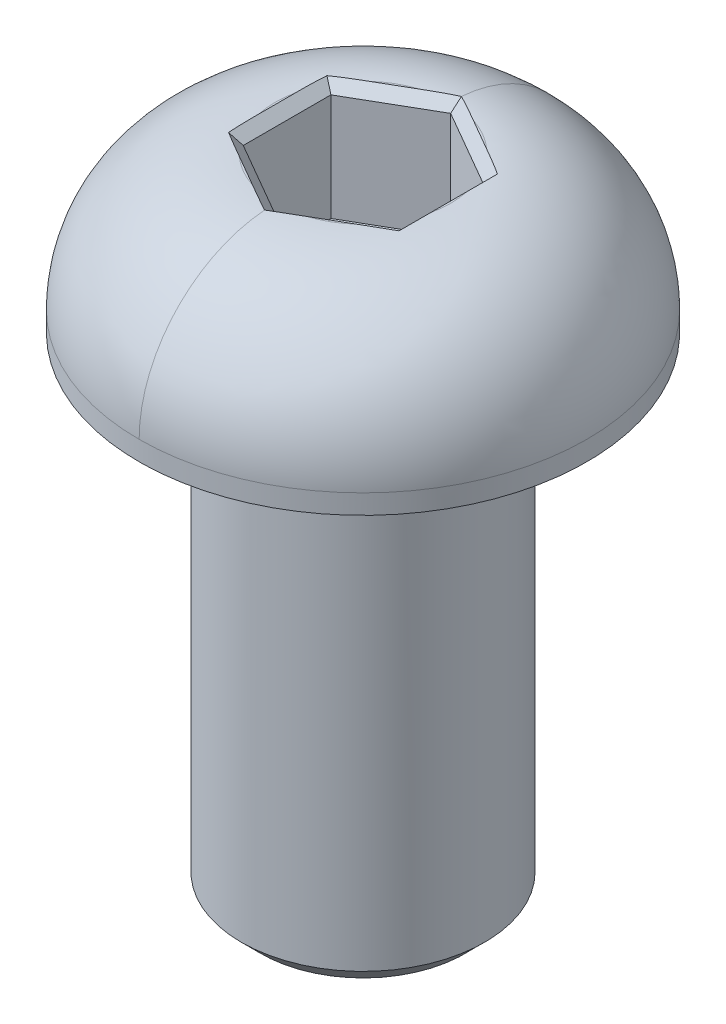
ISO-10303-21;
HEADER;
FILE_DESCRIPTION(('STEP AP214'),'2;1');
FILE_NAME('part.step','',(''),(''),'','','');
FILE_SCHEMA(('AUTOMOTIVE_DESIGN { 1 0 10303 214 1 1 1 1 }'));
ENDSEC;
DATA;
#1=APPLICATION_CONTEXT('core data for automotive mechanical design processes');
#2=APPLICATION_PROTOCOL_DEFINITION('international standard','automotive_design',2000,#1);
#3=PRODUCT_CONTEXT('',#1,'mechanical');
#4=PRODUCT('Part','Part','',(#3));
#5=PRODUCT_RELATED_PRODUCT_CATEGORY('part','',(#4));
#6=PRODUCT_DEFINITION_FORMATION('','',#4);
#7=PRODUCT_DEFINITION_CONTEXT('part definition',#1,'design');
#8=PRODUCT_DEFINITION('design','',#6,#7);
#9=PRODUCT_DEFINITION_SHAPE('','',#8);
#10=(LENGTH_UNIT() NAMED_UNIT(*) SI_UNIT(.MILLI.,.METRE.));
#11=(NAMED_UNIT(*) PLANE_ANGLE_UNIT() SI_UNIT($,.RADIAN.));
#12=(NAMED_UNIT(*) SI_UNIT($,.STERADIAN.) SOLID_ANGLE_UNIT());
#13=UNCERTAINTY_MEASURE_WITH_UNIT(LENGTH_MEASURE(1.E-05),#10,'distance_accuracy_value','');
#14=(GEOMETRIC_REPRESENTATION_CONTEXT(3) GLOBAL_UNCERTAINTY_ASSIGNED_CONTEXT((#13)) GLOBAL_UNIT_ASSIGNED_CONTEXT((#10,
#11,#12)) REPRESENTATION_CONTEXT('',''));
#15=CARTESIAN_POINT('',(0.,0.,0.));
#16=DIRECTION('',(0.,0.,1.));
#17=DIRECTION('',(1.,0.,0.));
#18=AXIS2_PLACEMENT_3D('',#15,#16,#17);
#19=CARTESIAN_POINT('',(0.55880000008816,-1.11759999977487,-0.967869991113236));
#20=DIRECTION('',(0.353553390699095,-0.70710678114419,-0.612372435683609));
#21=DIRECTION('',(0.,0.654653670722942,-0.755928946005494));
#22=AXIS2_PLACEMENT_3D('',#19,#20,#21);
#23=PLANE('',#22);
#24=CARTESIAN_POINT('',(1.53263941940356,0.,-1.69611686142561));
#25=CARTESIAN_POINT('',(1.57137439019135,-1.17832860178164E-06,-1.67375185499042));
#26=CARTESIAN_POINT('',(1.61009239010488,-3.70120175402417E-05,-1.65135663013081));
#27=CARTESIAN_POINT('',(1.68745429070755,-0.000245765725721834,-1.60645066795937));
#28=CARTESIAN_POINT('',(1.72609820022004,-0.000418668254930061,-1.58393994574912));
#29=CARTESIAN_POINT('',(1.80327785747174,-0.000969273808575009,-1.53874446531545));
#30=CARTESIAN_POINT('',(1.84181361550393,-0.00134695663002751,-1.5160597244778));
#31=CARTESIAN_POINT('',(1.91874334713456,-0.00237927994698004,-1.47045229890817));
#32=CARTESIAN_POINT('',(1.95713731322205,-0.00303393490776775,-1.44752960180958));
#33=CARTESIAN_POINT('',(2.03374194432457,-0.00469197365840326,-1.40138735916931));
#34=CARTESIAN_POINT('',(2.07195260074831,-0.00569537363430886,-1.37816779989777));
#35=CARTESIAN_POINT('',(2.14815301626423,-0.00811933718559276,-1.33137451745568));
#36=CARTESIAN_POINT('',(2.18614273140987,-0.00953998104167264,-1.30780072695751));
#37=CARTESIAN_POINT('',(2.22399670603845,-0.0112032937955187,-1.28402509637655));
#38=B_SPLINE_CURVE_WITH_KNOTS('',3,(#24,#25,#26,#27,#28,#29,#30,#31,#32,#33,#34,#35,#36,#37),
.UNSPECIFIED.,.F.,.F.,(4,2,2,2,2,2,4),(0.,0.134184534211138,0.268351949181293,0.402506130021046,
0.536667318130277,0.670834733800316,0.805027981169587),.UNSPECIFIED.);
#39=CARTESIAN_POINT('',(1.53263941949174,1.36519593373075E-11,-1.69611686157834));
#40=VERTEX_POINT('',#39);
#41=CARTESIAN_POINT('',(2.22399670602297,-0.0112032938027732,-1.28402509658571));
#42=VERTEX_POINT('',#41);
#43=EDGE_CURVE('E132',#40,#42,#38,.T.);
#44=ORIENTED_EDGE('',*,*,#43,.F.);
#45=DIRECTION('',(0.866025403784293,1.37929873100897E-10,0.500000000000251));
#46=VECTOR('',#45,1.);
#47=CARTESIAN_POINT('',(0.70256058008115,1.25700278907469E-10,-2.17536310305514));
#48=LINE('',#47,#46);
#49=CARTESIAN_POINT('',(0.702560580224696,1.61787532156066E-10,-2.1753631030966));
#50=VERTEX_POINT('',#49);
#51=EDGE_CURVE('E146',#50,#40,#48,.T.);
#52=ORIENTED_EDGE('',*,*,#51,.F.);
#53=CARTESIAN_POINT('',(1.81756312504369E-10,-0.011203293798371,-2.56805019358633));
#54=CARTESIAN_POINT('',(0.0395172875357603,-0.00953998104546036,-2.54715550521877));
#55=CARTESIAN_POINT('',(0.0789276465091941,-0.00811933718997857,-2.52604234207404));
#56=CARTESIAN_POINT('',(0.157552025520019,-0.00569537363937147,-2.48344748768956));
#57=CARTESIAN_POINT('',(0.19676608189158,-0.00469197366354472,-2.46196586817245));
#58=CARTESIAN_POINT('',(0.275028751688698,-0.00303393491270319,-2.41869543292134));
#59=CARTESIAN_POINT('',(0.314077372709027,-0.00237927995163063,-2.39690663149254));
#60=CARTESIAN_POINT('',(0.392039427600789,-0.0013469566339039,-2.35308724239055));
#61=CARTESIAN_POINT('',(0.430952868426554,-0.00096927381196208,-2.33105666740535));
#62=CARTESIAN_POINT('',(0.508683131176164,-0.000418668257289082,-2.28681486379874));
#63=CARTESIAN_POINT('',(0.547499943189995,-0.000245765727542118,-2.2646036175705));
#64=CARTESIAN_POINT('',(0.625070597445046,-3.70120183605279E-05,-2.2200592274612));
#65=CARTESIAN_POINT('',(0.6638244310196,-1.17832896081932E-06,-2.1977260683881));
#66=CARTESIAN_POINT('',(0.702560580108006,0.,-2.17536310289449));
#67=B_SPLINE_CURVE_WITH_KNOTS('',3,(#53,#54,#55,#56,#57,#58,#59,#60,#61,#62,#63,#64,#65,#66),
.UNSPECIFIED.,.F.,.F.,(4,2,2,2,2,2,4),(0.,0.134193247271708,0.268360662844213,0.402521850855909,
0.536676031598142,0.670843446470765,0.805027980584359),.UNSPECIFIED.);
#68=CARTESIAN_POINT('',(3.99852078221205E-13,-0.0112032939946817,-2.56805019335987));
#69=VERTEX_POINT('',#68);
#70=EDGE_CURVE('E172',#69,#50,#67,.T.);
#71=ORIENTED_EDGE('',*,*,#70,.F.);
#72=DIRECTION('',(0.,0.654653670722942,-0.755928946005494));
#73=VECTOR('',#72,1.);
#74=CARTESIAN_POINT('',(-1.80956378353914E-10,-1.27725714265737,-1.10613713275066));
#75=LINE('',#74,#73);
#76=CARTESIAN_POINT('',(-1.2585625451337E-10,-0.25400000013253,-2.28769270643843));
#77=VERTEX_POINT('',#76);
#78=EDGE_CURVE('E177',#69,#77,#75,.F.);
#79=ORIENTED_EDGE('',*,*,#78,.T.);
#80=DIRECTION('',(0.866025403798195,0.,0.499999999976173));
#81=VECTOR('',#80,1.);
#82=CARTESIAN_POINT('',(0.990599999995912,-0.254000000254,-1.71576953007967));
#83=LINE('',#82,#81);
#84=CARTESIAN_POINT('',(1.98120000002931,-0.25400000014488,-1.14384635318362));
#85=VERTEX_POINT('',#84);
#86=EDGE_CURVE('E158',#77,#85,#83,.T.);
#87=ORIENTED_EDGE('',*,*,#86,.T.);
#88=DIRECTION('',(0.654653670638327,0.654653670638327,-0.377964473250503));
#89=VECTOR('',#88,1.);
#90=CARTESIAN_POINT('',(1.98119999990876,-0.253999999908761,-1.143846353146));
#91=LINE('',#90,#89);
#92=EDGE_CURVE('E151',#85,#42,#91,.T.);
#93=ORIENTED_EDGE('',*,*,#92,.T.);
#94=EDGE_LOOP('',(#44,#52,#71,#79,#87,#93));
#95=FACE_BOUND('',#94,.T.);
#96=ADVANCED_FACE('F17',(#95),#23,.F.);
#97=CARTESIAN_POINT('',(1.11759999990876,-1.11759999990876,0.));
#98=DIRECTION('',(0.707106781186548,-0.707106781186548,0.));
#99=DIRECTION('',(0.707106781186548,0.707106781186548,0.));
#100=AXIS2_PLACEMENT_3D('',#97,#98,#99);
#101=PLANE('',#100);
#102=CARTESIAN_POINT('',(2.22399670600749,-0.0112032938100277,-1.28402509679487));
#103=CARTESIAN_POINT('',(2.22566001876077,-0.00953998105674944,-1.23935477787781));
#104=CARTESIAN_POINT('',(2.22708066261671,-0.00811933720081239,-1.1946678242661));
#105=CARTESIAN_POINT('',(2.22950462616836,-0.0056953736491573,-1.10527968750146));
#106=CARTESIAN_POINT('',(2.23050802614478,-0.00469197367273785,-1.06057850874354));
#107=CARTESIAN_POINT('',(2.23216606489691,-0.00303393492061117,-0.971165830913308));
#108=CARTESIAN_POINT('',(2.23282071985868,-0.00237927995884613,-0.926454332416339));
#109=CARTESIAN_POINT('',(2.23385304317784,-0.00134695663968139,-0.837027517805359));
#110=CARTESIAN_POINT('',(2.23423072600053,-0.000969273816994053,-0.792312202012716));
#111=CARTESIAN_POINT('',(2.23478133155669,-0.000418668260826974,-0.702874918032848));
#112=CARTESIAN_POINT('',(2.23495423408719,-0.000245765730331443,-0.658152949624524));
#113=CARTESIAN_POINT('',(2.23516298779782,-3.70120197035529E-05,-0.5687025974042));
#114=CARTESIAN_POINT('',(2.23519882148792,-1.17832960611645E-06,-0.523974213501729));
#115=CARTESIAN_POINT('',(2.23519999981752,0.,-0.479246241603253));
#116=B_SPLINE_CURVE_WITH_KNOTS('',3,(#102,#103,#104,#105,#106,#107,#108,#109,#110,#111,#112,
#113,#114,#115),.UNSPECIFIED.,.F.,.F.,(4,2,2,2,2,2,4),(0.,0.134193247260689,0.268360662822183,
0.402521850822866,0.536676031554091,0.670843446415702,0.805027980518283),.UNSPECIFIED.);
#117=CARTESIAN_POINT('',(2.23520000021273,3.64959798491988E-11,-0.479246241603254));
#118=VERTEX_POINT('',#117);
#119=EDGE_CURVE('E137',#42,#118,#116,.T.);
#120=ORIENTED_EDGE('',*,*,#119,.F.);
#121=ORIENTED_EDGE('',*,*,#92,.F.);
#122=DIRECTION('',(0.,0.,1.));
#123=VECTOR('',#122,1.);
#124=CARTESIAN_POINT('',(1.98120000018064,-0.254000000254,0.));
#125=LINE('',#124,#123);
#126=CARTESIAN_POINT('',(1.98119999998124,-0.254000000181254,1.14384635356457));
#127=VERTEX_POINT('',#126);
#128=EDGE_CURVE('E186',#85,#127,#125,.T.);
#129=ORIENTED_EDGE('',*,*,#128,.T.);
#130=DIRECTION('',(-0.654653671026164,-0.654653671026163,-0.377964471906997));
#131=VECTOR('',#130,1.);
#132=CARTESIAN_POINT('',(2.22399670608222,-0.0112032937353004,1.284025096918));
#133=LINE('',#132,#131);
#134=CARTESIAN_POINT('',(2.22399670606033,-0.0112032937654095,1.28402509664728));
#135=VERTEX_POINT('',#134);
#136=EDGE_CURVE('E160',#135,#127,#133,.T.);
#137=ORIENTED_EDGE('',*,*,#136,.F.);
#138=CARTESIAN_POINT('',(2.23519999981752,0.,0.479246241615994));
#139=CARTESIAN_POINT('',(2.23519882148791,-1.17832961283746E-06,0.523974213513763));
#140=CARTESIAN_POINT('',(2.2351629877978,-3.701201971902E-05,0.568702597415526));
#141=CARTESIAN_POINT('',(2.23495423408716,-0.000245765730365398,0.658152949634433));
#142=CARTESIAN_POINT('',(2.23478133155665,-0.00041866826087067,0.70287491804205));
#143=CARTESIAN_POINT('',(2.23423072600047,-0.000969273817055175,0.792312202020502));
#144=CARTESIAN_POINT('',(2.23385304317777,-0.0013469566397502,0.837027517812437));
#145=CARTESIAN_POINT('',(2.2328207198586,-0.00237927995892472,0.926454332422001));
#146=CARTESIAN_POINT('',(2.23216606489683,-0.00303393492069185,0.971165830918261));
#147=CARTESIAN_POINT('',(2.23050802614471,-0.00469197367281408,1.06057850874707));
#148=CARTESIAN_POINT('',(2.22950462616829,-0.00569537364922697,1.10527968750429));
#149=CARTESIAN_POINT('',(2.22708066261667,-0.0081193372008571,1.19466782426751));
#150=CARTESIAN_POINT('',(2.22566001876075,-0.00953998105677574,1.23935477787852));
#151=CARTESIAN_POINT('',(2.22399670600749,-0.0112032938100281,1.28402509679487));
#152=B_SPLINE_CURVE_WITH_KNOTS('',3,(#138,#139,#140,#141,#142,#143,#144,#145,#146,#147,#148,
#149,#150,#151),.UNSPECIFIED.,.F.,.F.,(4,2,2,2,2,2,4),(0.,0.134184534100457,0.268351948959945,
0.402506129689047,0.536667317687605,0.670834733246976,0.805027980505541),.UNSPECIFIED.);
#153=CARTESIAN_POINT('',(2.23520000020999,3.64959798491988E-11,0.479246241615994));
#154=VERTEX_POINT('',#153);
#155=EDGE_CURVE('E145',#154,#135,#152,.T.);
#156=ORIENTED_EDGE('',*,*,#155,.F.);
#157=DIRECTION('',(0.,0.,1.));
#158=VECTOR('',#157,1.);
#159=CARTESIAN_POINT('',(2.23519999990876,9.12395159424761E-11,0.));
#160=LINE('',#159,#158);
#161=EDGE_CURVE('E154',#118,#154,#160,.T.);
#162=ORIENTED_EDGE('',*,*,#161,.F.);
#163=EDGE_LOOP('',(#120,#121,#129,#137,#156,#162));
#164=FACE_BOUND('',#163,.T.);
#165=ADVANCED_FACE('F149',(#164),#101,.F.);
#166=CARTESIAN_POINT('',(-0.55880000008816,-1.11759999977487,-0.967869991113236));
#167=DIRECTION('',(-0.353553390699095,-0.70710678114419,-0.612372435683609));
#168=DIRECTION('',(0.,0.654653670722942,-0.755928946005494));
#169=AXIS2_PLACEMENT_3D('',#166,#167,#168);
#170=PLANE('',#169);
#171=CARTESIAN_POINT('',(-0.702560579821058,0.,-2.17536310306016));
#172=CARTESIAN_POINT('',(-0.599885437734528,-7.91210805137905E-06,-2.23463348788639));
#173=CARTESIAN_POINT('',(-0.497054073452321,-0.000246505182078015,-2.29372770020379));
#174=CARTESIAN_POINT('',(-0.290583942204975,-0.00249758739843342,-2.41033396025006));
#175=CARTESIAN_POINT('',(-0.186945546020749,-0.00450930464810947,-2.46784668521333));
#176=CARTESIAN_POINT('',(-0.0688680918683361,-0.00853123218839473,-2.53137461327931));
#177=CARTESIAN_POINT('',(-0.055112353702279,-0.00902612451049675,-2.53874503998417));
#178=CARTESIAN_POINT('',(-0.0275753142902426,-0.0100720038049132,-2.55343587972218));
#179=CARTESIAN_POINT('',(-0.0137940116239663,-0.0106229939914538,-2.56075628986386));
#180=CARTESIAN_POINT('',(-2.28599127699944E-10,-0.0112032937963999,-2.56805019356156));
#181=B_SPLINE_CURVE_WITH_KNOTS('',3,(#171,#172,#173,#174,#175,#176,#177,#178,#179,#180),
.UNSPECIFIED.,.F.,.F.,(4,2,2,2,4),(0.,0.355743000096745,0.711331211340018,0.758172105075962,
0.805015684155642),.UNSPECIFIED.);
#182=CARTESIAN_POINT('',(-0.702560579899938,1.01690460986918E-10,-2.17536310319679));
#183=VERTEX_POINT('',#182);
#184=EDGE_CURVE('E438',#183,#69,#181,.T.);
#185=ORIENTED_EDGE('',*,*,#184,.F.);
#186=DIRECTION('',(0.866025403735795,-4.09335199963477E-11,-0.500000000084253));
#187=VECTOR('',#186,1.);
#188=CARTESIAN_POINT('',(-1.53263941966978,-1.35550696101633E-10,-1.69611686111539));
#189=LINE('',#188,#187);
#190=CARTESIAN_POINT('',(-1.53263941967433,-6.50391241119057E-11,-1.69611686136433));
#191=VERTEX_POINT('',#190);
#192=EDGE_CURVE('E441',#191,#183,#189,.T.);
#193=ORIENTED_EDGE('',*,*,#192,.F.);
#194=CARTESIAN_POINT('',(-2.22399670612658,-0.0112032937993895,-1.2840250963212));
#195=CARTESIAN_POINT('',(-2.12359970769343,-0.00678864891437466,-1.34708692323553));
#196=CARTESIAN_POINT('',(-2.02227987916346,-0.00409120035325785,-1.40869869883619));
#197=CARTESIAN_POINT('',(-1.81854295069719,-0.000816546179633327,-1.53010751430542));
#198=CARTESIAN_POINT('',(-1.71612607208397,-0.000238920694862305,-1.5899049112198));
#199=CARTESIAN_POINT('',(-1.60004164331493,-4.10193608685985E-05,-1.65715480421604));
#200=CARTESIAN_POINT('',(-1.58656535444127,-2.49929799994664E-05,-1.66495384889794));
#201=CARTESIAN_POINT('',(-1.55960665551686,-4.45367236210272E-06,-1.6805421777334));
#202=CARTESIAN_POINT('',(-1.54612424531598,5.89548737686981E-08,-1.68833146162777));
#203=CARTESIAN_POINT('',(-1.53263941963317,0.,-1.69611686129304));
#204=B_SPLINE_CURVE_WITH_KNOTS('',3,(#194,#195,#196,#197,#198,#199,#200,#201,#202,#203),
.UNSPECIFIED.,.F.,.F.,(4,2,2,2,4),(0.,0.355828535544317,0.711586588509131,0.758297774887473,
0.805010176453295),.UNSPECIFIED.);
#205=CARTESIAN_POINT('',(-2.22399670625934,-0.011203293612405,-1.2840250963656));
#206=VERTEX_POINT('',#205);
#207=EDGE_CURVE('E443',#206,#191,#204,.T.);
#208=ORIENTED_EDGE('',*,*,#207,.F.);
#209=DIRECTION('',(0.654653671484444,-0.654653671484443,0.377964470319469));
#210=VECTOR('',#209,1.);
#211=CARTESIAN_POINT('',(-2.2239967063921,-0.0112032934254205,-1.28402509641));
#212=LINE('',#211,#210);
#213=CARTESIAN_POINT('',(-1.98119999978176,-0.254000000035761,-1.143846353654));
#214=VERTEX_POINT('',#213);
#215=EDGE_CURVE('E412',#206,#214,#212,.T.);
#216=ORIENTED_EDGE('',*,*,#215,.T.);
#217=DIRECTION('',(0.866025403798195,0.,-0.499999999976173));
#218=VECTOR('',#217,1.);
#219=CARTESIAN_POINT('',(-0.990599999995912,-0.254000000254,-1.71576953007967));
#220=LINE('',#219,#218);
#221=EDGE_CURVE('E183',#214,#77,#220,.T.);
#222=ORIENTED_EDGE('',*,*,#221,.T.);
#223=ORIENTED_EDGE('',*,*,#78,.F.);
#224=EDGE_LOOP('',(#185,#193,#208,#216,#222,#223));
#225=FACE_BOUND('',#224,.T.);
#226=ADVANCED_FACE('F488',(#225),#170,.F.);
#227=CARTESIAN_POINT('',(0.990599999995912,0.,-1.71576953007967));
#228=DIRECTION('',(-0.499999999976173,0.,0.866025403798195));
#229=DIRECTION('',(0.866025403798195,0.,0.499999999976173));
#230=AXIS2_PLACEMENT_3D('',#227,#228,#229);
#231=PLANE('',#230);
#232=ORIENTED_EDGE('',*,*,#86,.F.);
#233=DIRECTION('',(0.,1.,0.));
#234=VECTOR('',#233,1.);
#235=CARTESIAN_POINT('',(2.99772576553559E-10,0.,-2.28769270687328));
#236=LINE('',#235,#234);
#237=CARTESIAN_POINT('',(2.8874395246984E-10,-3.04800000003226,-2.2876927067809));
#238=VERTEX_POINT('',#237);
#239=EDGE_CURVE('E180',#77,#238,#236,.F.);
#240=ORIENTED_EDGE('',*,*,#239,.T.);
#241=DIRECTION('',(0.866025403711307,0.,0.500000000126667));
#242=VECTOR('',#241,1.);
#243=CARTESIAN_POINT('',(3.42081474332E-10,-3.04800000012903,-2.2876927068));
#244=LINE('',#243,#242);
#245=CARTESIAN_POINT('',(1.98120000027068,-3.04800000003226,-1.14384635320666));
#246=VERTEX_POINT('',#245);
#247=EDGE_CURVE('E407',#238,#246,#244,.T.);
#248=ORIENTED_EDGE('',*,*,#247,.T.);
#249=DIRECTION('',(0.,1.,0.));
#250=VECTOR('',#249,1.);
#251=CARTESIAN_POINT('',(1.98120000018064,0.,-1.143846353146));
#252=LINE('',#251,#250);
#253=EDGE_CURVE('E176',#246,#85,#252,.T.);
#254=ORIENTED_EDGE('',*,*,#253,.T.);
#255=EDGE_LOOP('',(#232,#240,#248,#254));
#256=FACE_BOUND('',#255,.T.);
#257=ADVANCED_FACE('F492',(#256),#231,.T.);
#258=CARTESIAN_POINT('',(1.98120000018064,0.,0.));
#259=DIRECTION('',(-1.,0.,0.));
#260=DIRECTION('',(0.,0.,1.));
#261=AXIS2_PLACEMENT_3D('',#258,#259,#260);
#262=PLANE('',#261);
#263=ORIENTED_EDGE('',*,*,#128,.F.);
#264=ORIENTED_EDGE('',*,*,#253,.F.);
#265=DIRECTION('',(0.,0.,-1.));
#266=VECTOR('',#265,1.);
#267=CARTESIAN_POINT('',(1.981200000254,-3.04800000012903,0.));
#268=LINE('',#267,#266);
#269=CARTESIAN_POINT('',(1.98120000015055,-3.04800000006452,1.14384635354325));
#270=VERTEX_POINT('',#269);
#271=EDGE_CURVE('E405',#246,#270,#268,.F.);
#272=ORIENTED_EDGE('',*,*,#271,.T.);
#273=DIRECTION('',(0.,1.,0.));
#274=VECTOR('',#273,1.);
#275=CARTESIAN_POINT('',(1.98119999991357,0.,1.1438463535043));
#276=LINE('',#275,#274);
#277=EDGE_CURVE('E195',#270,#127,#276,.T.);
#278=ORIENTED_EDGE('',*,*,#277,.T.);
#279=EDGE_LOOP('',(#263,#264,#272,#278));
#280=FACE_BOUND('',#279,.T.);
#281=ADVANCED_FACE('F589',(#280),#262,.T.);
#282=CARTESIAN_POINT('',(0.55880000008816,-1.11759999977487,0.967869991113236));
#283=DIRECTION('',(0.353553390699095,-0.70710678114419,0.612372435683609));
#284=DIRECTION('',(0.,-0.654653670722942,-0.755928946005494));
#285=AXIS2_PLACEMENT_3D('',#282,#283,#284);
#286=PLANE('',#285);
#287=CARTESIAN_POINT('',(0.702560580172965,0.,2.17536310285699));
#288=CARTESIAN_POINT('',(0.663824431082856,-1.17832892006866E-06,2.19772606835163));
#289=CARTESIAN_POINT('',(0.625070597506607,-3.70120182649521E-05,2.22005922742577));
#290=CARTESIAN_POINT('',(0.547499943248174,-0.000245765727315205,2.26460361753717));
#291=CARTESIAN_POINT('',(0.508683131232657,-0.000418668256985663,2.28681486376648));
#292=CARTESIAN_POINT('',(0.430952868479683,-0.000969273811490117,2.33105666737522));
#293=CARTESIAN_POINT('',(0.392039427652239,-0.00134695663333991,2.3530872423615));
#294=CARTESIAN_POINT('',(0.314077372757119,-0.00237927995087675,2.39690663146565));
#295=CARTESIAN_POINT('',(0.275028751735113,-0.00303393491185146,2.41869543289552));
#296=CARTESIAN_POINT('',(0.196766081934636,-0.00469197366250117,2.4619658681488));
#297=CARTESIAN_POINT('',(0.157552025561395,-0.00569537363823397,2.48344748766699));
#298=CARTESIAN_POINT('',(0.0789276465471984,-0.00811933718866779,2.52604234205361));
#299=CARTESIAN_POINT('',(0.0395172875720748,-0.00953998104407025,2.54715550519941));
#300=CARTESIAN_POINT('',(2.1637411648456E-10,-0.0112032937969143,2.56805019356802));
#301=B_SPLINE_CURVE_WITH_KNOTS('',3,(#287,#288,#289,#290,#291,#292,#293,#294,#295,#296,#297,
#298,#299,#300),.UNSPECIFIED.,.F.,.F.,(4,2,2,2,2,2,4),(0.,0.134184534119562,0.268351948998156,
0.40250612974636,0.536667317764027,0.670834733342503,0.80502798062018),.UNSPECIFIED.);
#302=CARTESIAN_POINT('',(0.70256058031501,1.61787532155977E-10,2.17536310310302));
#303=VERTEX_POINT('',#302);
#304=CARTESIAN_POINT('',(5.82806819335051E-12,-0.0112032939949438,2.56805019336317));
#305=VERTEX_POINT('',#304);
#306=EDGE_CURVE('E430',#303,#305,#301,.T.);
#307=ORIENTED_EDGE('',*,*,#306,.F.);
#308=DIRECTION('',(-0.866025403784293,-1.37929873100897E-10,0.500000000000251));
#309=VECTOR('',#308,1.);
#310=CARTESIAN_POINT('',(1.53263941972705,2.57905025460858E-10,1.69611686153665));
#311=LINE('',#310,#309);
#312=CARTESIAN_POINT('',(1.53263941957674,1.36519593372188E-11,1.69611686154716));
#313=VERTEX_POINT('',#312);
#314=EDGE_CURVE('E433',#313,#303,#311,.T.);
#315=ORIENTED_EDGE('',*,*,#314,.F.);
#316=CARTESIAN_POINT('',(2.22399670603844,-0.0112032937955185,1.28402509637655));
#317=CARTESIAN_POINT('',(2.18614273141407,-0.00953998104185745,1.30780072695488));
#318=CARTESIAN_POINT('',(2.14815301627265,-0.00811933718590806,1.33137451745046));
#319=CARTESIAN_POINT('',(2.07195260076522,-0.00569537363479997,1.37816779988744));
#320=CARTESIAN_POINT('',(2.03374194434575,-0.00469197365893972,1.40138735915646));
#321=CARTESIAN_POINT('',(1.9571373132518,-0.00303393490833347,1.44752960179175));
#322=CARTESIAN_POINT('',(1.91874334716861,-0.00237927994752969,1.47045229888787));
#323=CARTESIAN_POINT('',(1.8418136155466,-0.00134695663050767,1.5160597244526));
#324=CARTESIAN_POINT('',(1.80327785751874,-0.000969273809001763,1.53874446528783));
#325=CARTESIAN_POINT('',(1.72609820027568,-0.000418668255235833,1.58393994571664));
#326=CARTESIAN_POINT('',(1.68745429076751,-0.00024576572596003,1.60645066792447));
#327=CARTESIAN_POINT('',(1.6100923901735,-3.70120176495535E-05,1.65135663009107));
#328=CARTESIAN_POINT('',(1.57137439026428,-1.17832864978513E-06,1.67375185494826));
#329=CARTESIAN_POINT('',(1.53263941948082,0.,1.69611686138101));
#330=B_SPLINE_CURVE_WITH_KNOTS('',3,(#316,#317,#318,#319,#320,#321,#322,#323,#324,#325,#326,
#327,#328,#329),.UNSPECIFIED.,.F.,.F.,(4,2,2,2,2,2,4),(0.,0.134193247354398,0.268360663009571,
0.402521851103934,0.536676031928823,0.670843446884113,0.805027981080381),.UNSPECIFIED.);
#331=EDGE_CURVE('E188',#135,#313,#330,.T.);
#332=ORIENTED_EDGE('',*,*,#331,.F.);
#333=ORIENTED_EDGE('',*,*,#136,.T.);
#334=DIRECTION('',(-0.866025403798195,0.,0.499999999976173));
#335=VECTOR('',#334,1.);
#336=CARTESIAN_POINT('',(0.990599999995912,-0.254000000254,1.71576953007967));
#337=LINE('',#336,#335);
#338=CARTESIAN_POINT('',(1.52927603658269E-10,-0.254000000035524,2.28769270627755));
#339=VERTEX_POINT('',#338);
#340=EDGE_CURVE('E198',#127,#339,#337,.T.);
#341=ORIENTED_EDGE('',*,*,#340,.T.);
#342=DIRECTION('',(0.,-0.654653670722942,-0.755928946005494));
#343=VECTOR('',#342,1.);
#344=CARTESIAN_POINT('',(1.80956378353914E-10,-1.27725714265737,1.10613713275066));
#345=LINE('',#344,#343);
#346=EDGE_CURVE('E426',#305,#339,#345,.T.);
#347=ORIENTED_EDGE('',*,*,#346,.F.);
#348=EDGE_LOOP('',(#307,#315,#332,#333,#341,#347));
#349=FACE_BOUND('',#348,.T.);
#350=ADVANCED_FACE('F584',(#349),#286,.F.);
#351=CARTESIAN_POINT('',(-1.11759999990876,-1.11759999990876,0.));
#352=DIRECTION('',(-0.707106781186548,-0.707106781186548,0.));
#353=DIRECTION('',(0.707106781186548,-0.707106781186548,0.));
#354=AXIS2_PLACEMENT_3D('',#351,#352,#353);
#355=PLANE('',#354);
#356=CARTESIAN_POINT('',(-2.23519999981752,0.,-0.479246241786363));
#357=CARTESIAN_POINT('',(-2.23519208770792,-7.91210960437939E-06,-0.597800715583591));
#358=CARTESIAN_POINT('',(-2.23495349463227,-0.000246505185253338,-0.716402395516434));
#359=CARTESIAN_POINT('',(-2.23270241241305,-0.00249758740447142,-0.953513904322091));
#360=CARTESIAN_POINT('',(-2.23069069516214,-0.00450930465538823,-1.07202375070642));
#361=CARTESIAN_POINT('',(-2.22666876762081,-0.00853123219671456,-1.20604578965382));
#362=CARTESIAN_POINT('',(-2.22617387529845,-0.00902612451907523,-1.22164382171064));
#363=CARTESIAN_POINT('',(-2.22512799600349,-0.0100720038140294,-1.25283701726502));
#364=CARTESIAN_POINT('',(-2.22457700581667,-0.0106229940008491,-1.26843218054686));
#365=CARTESIAN_POINT('',(-2.22399670601144,-0.0112032938060858,-1.28402509668895));
#366=B_SPLINE_CURVE_WITH_KNOTS('',3,(#356,#357,#358,#359,#360,#361,#362,#363,#364,#365),
.UNSPECIFIED.,.F.,.F.,(4,2,2,2,4),(0.,0.355743000096709,0.711331211339997,0.758172105090509,
0.805015684184759),.UNSPECIFIED.);
#367=CARTESIAN_POINT('',(-2.23520000031197,1.38095996856363E-10,-0.479246241786364));
#368=VERTEX_POINT('',#367);
#369=EDGE_CURVE('E415',#368,#206,#366,.T.);
#370=ORIENTED_EDGE('',*,*,#369,.F.);
#371=DIRECTION('',(0.,0.,1.));
#372=VECTOR('',#371,1.);
#373=CARTESIAN_POINT('',(-2.23520000041676,5.99239408094476E-10,0.));
#374=LINE('',#373,#372);
#375=CARTESIAN_POINT('',(-2.23520000030499,1.38095996856363E-10,0.479246241818928));
#376=VERTEX_POINT('',#375);
#377=EDGE_CURVE('E418',#376,#368,#374,.F.);
#378=ORIENTED_EDGE('',*,*,#377,.F.);
#379=CARTESIAN_POINT('',(-2.22399670600577,-0.0112032938117557,1.28402509684128));
#380=CARTESIAN_POINT('',(-2.2284113508917,-0.00678864892526098,1.16554783227685));
#381=CARTESIAN_POINT('',(-2.23110879945494,-0.00409120036228867,1.0469963990622));
#382=CARTESIAN_POINT('',(-2.23438345363302,-0.000816546184796398,0.809850635586444));
#383=CARTESIAN_POINT('',(-2.23496107912013,-0.000238920698012976,0.691256318473851));
#384=CARTESIAN_POINT('',(-2.23515898045549,-4.10193621515933E-05,0.557099307787838));
#385=CARTESIAN_POINT('',(-2.23517500683645,-2.49929811147618E-05,0.541528977043473));
#386=CARTESIAN_POINT('',(-2.23519554614447,-4.45367300733344E-06,0.510387894724042));
#387=CARTESIAN_POINT('',(-2.235200058772,5.89545309086262E-08,0.494817143148567));
#388=CARTESIAN_POINT('',(-2.23519999981752,0.,0.479246241818928));
#389=B_SPLINE_CURVE_WITH_KNOTS('',3,(#379,#380,#381,#382,#383,#384,#385,#386,#387,#388),
.UNSPECIFIED.,.F.,.F.,(4,2,2,2,4),(0.,0.35582853554431,0.711586588509087,0.758297774557704,
0.805010175793784),.UNSPECIFIED.);
#390=CARTESIAN_POINT('',(-2.22399670603025,-0.0112032938039946,1.2840250966038));
#391=VERTEX_POINT('',#390);
#392=EDGE_CURVE('E420',#391,#376,#389,.T.);
#393=ORIENTED_EDGE('',*,*,#392,.F.);
#394=DIRECTION('',(-0.654653670578935,0.654653670578934,0.377964473456244));
#395=VECTOR('',#394,1.);
#396=CARTESIAN_POINT('',(-1.98119999990876,-0.253999999908761,1.143846353146));
#397=LINE('',#396,#395);
#398=CARTESIAN_POINT('',(-1.9811999999812,-0.25400000014488,1.14384635307668));
#399=VERTEX_POINT('',#398);
#400=EDGE_CURVE('E423',#399,#391,#397,.T.);
#401=ORIENTED_EDGE('',*,*,#400,.F.);
#402=DIRECTION('',(0.,0.,-1.));
#403=VECTOR('',#402,1.);
#404=CARTESIAN_POINT('',(-1.98120000018064,-0.254000000254,0.));
#405=LINE('',#404,#403);
#406=EDGE_CURVE('E402',#399,#214,#405,.T.);
#407=ORIENTED_EDGE('',*,*,#406,.T.);
#408=ORIENTED_EDGE('',*,*,#215,.F.);
#409=EDGE_LOOP('',(#370,#378,#393,#401,#407,#408));
#410=FACE_BOUND('',#409,.T.);
#411=ADVANCED_FACE('F588',(#410),#355,.F.);
#412=CARTESIAN_POINT('',(-0.990599999995912,0.,-1.71576953007967));
#413=DIRECTION('',(0.499999999976173,0.,0.866025403798195));
#414=DIRECTION('',(0.866025403798195,0.,-0.499999999976173));
#415=AXIS2_PLACEMENT_3D('',#412,#413,#414);
#416=PLANE('',#415);
#417=ORIENTED_EDGE('',*,*,#221,.F.);
#418=DIRECTION('',(0.,1.,0.));
#419=VECTOR('',#418,1.);
#420=CARTESIAN_POINT('',(-1.98120000018064,0.,-1.143846353654));
#421=LINE('',#420,#419);
#422=CARTESIAN_POINT('',(-1.98120000015055,-3.04800000006452,-1.14384635354325));
#423=VERTEX_POINT('',#422);
#424=EDGE_CURVE('E398',#214,#423,#421,.F.);
#425=ORIENTED_EDGE('',*,*,#424,.T.);
#426=DIRECTION('',(0.866025403854469,0.,-0.499999999878703));
#427=VECTOR('',#426,1.);
#428=CARTESIAN_POINT('',(-1.9812,-3.04800000012903,-1.143846353654));
#429=LINE('',#428,#427);
#430=EDGE_CURVE('E182',#423,#238,#429,.T.);
#431=ORIENTED_EDGE('',*,*,#430,.T.);
#432=ORIENTED_EDGE('',*,*,#239,.F.);
#433=EDGE_LOOP('',(#417,#425,#431,#432));
#434=FACE_BOUND('',#433,.T.);
#435=ADVANCED_FACE('F607',(#434),#416,.T.);
#436=CARTESIAN_POINT('',(0.,-3.04800000012903,0.));
#437=DIRECTION('',(0.,-1.,0.));
#438=DIRECTION('',(0.,0.,-1.));
#439=AXIS2_PLACEMENT_3D('',#436,#437,#438);
#440=PLANE('',#439);
#441=DIRECTION('',(-0.866025403798195,0.,0.499999999976173));
#442=VECTOR('',#441,1.);
#443=CARTESIAN_POINT('',(0.990599999995912,-3.048,1.71576953007967));
#444=LINE('',#443,#442);
#445=CARTESIAN_POINT('',(0.,-3.04800000006452,2.28769270660383));
#446=VERTEX_POINT('',#445);
#447=EDGE_CURVE('E199',#446,#270,#444,.F.);
#448=ORIENTED_EDGE('',*,*,#447,.T.);
#449=ORIENTED_EDGE('',*,*,#271,.F.);
#450=ORIENTED_EDGE('',*,*,#247,.F.);
#451=ORIENTED_EDGE('',*,*,#430,.F.);
#452=DIRECTION('',(0.,0.,-1.));
#453=VECTOR('',#452,1.);
#454=CARTESIAN_POINT('',(-1.98120000018064,-3.048,0.));
#455=LINE('',#454,#453);
#456=CARTESIAN_POINT('',(-1.98120000025317,-3.04800000006452,1.14384635317633));
#457=VERTEX_POINT('',#456);
#458=EDGE_CURVE('E399',#423,#457,#455,.F.);
#459=ORIENTED_EDGE('',*,*,#458,.T.);
#460=DIRECTION('',(-0.866025403798195,0.,-0.499999999976173));
#461=VECTOR('',#460,1.);
#462=CARTESIAN_POINT('',(-0.990599999995912,-3.048,1.71576953007967));
#463=LINE('',#462,#461);
#464=EDGE_CURVE('E389',#457,#446,#463,.F.);
#465=ORIENTED_EDGE('',*,*,#464,.T.);
#466=EDGE_LOOP('',(#448,#449,#450,#451,#459,#465));
#467=FACE_BOUND('',#466,.T.);
#468=ADVANCED_FACE('F604',(#467),#440,.F.);
#469=CARTESIAN_POINT('',(0.990599999995912,0.,1.71576953007967));
#470=DIRECTION('',(-0.499999999976173,0.,-0.866025403798195));
#471=DIRECTION('',(-0.866025403798195,0.,0.499999999976173));
#472=AXIS2_PLACEMENT_3D('',#469,#470,#471);
#473=PLANE('',#472);
#474=ORIENTED_EDGE('',*,*,#340,.F.);
#475=ORIENTED_EDGE('',*,*,#277,.F.);
#476=ORIENTED_EDGE('',*,*,#447,.F.);
#477=DIRECTION('',(0.,1.,0.));
#478=VECTOR('',#477,1.);
#479=CARTESIAN_POINT('',(-6.67738433990372E-11,0.,2.28769270666166));
#480=LINE('',#479,#478);
#481=EDGE_CURVE('E397',#446,#339,#480,.T.);
#482=ORIENTED_EDGE('',*,*,#481,.T.);
#483=EDGE_LOOP('',(#474,#475,#476,#482));
#484=FACE_BOUND('',#483,.T.);
#485=ADVANCED_FACE('F623',(#484),#473,.T.);
#486=CARTESIAN_POINT('',(-1.98120000018064,0.,0.));
#487=DIRECTION('',(1.,0.,0.));
#488=DIRECTION('',(0.,0.,-1.));
#489=AXIS2_PLACEMENT_3D('',#486,#487,#488);
#490=PLANE('',#489);
#491=ORIENTED_EDGE('',*,*,#406,.F.);
#492=DIRECTION('',(0.,1.,0.));
#493=VECTOR('',#492,1.);
#494=CARTESIAN_POINT('',(-1.98120000032404,0.,1.14384635326731));
#495=LINE('',#494,#493);
#496=EDGE_CURVE('E458',#399,#457,#495,.F.);
#497=ORIENTED_EDGE('',*,*,#496,.T.);
#498=ORIENTED_EDGE('',*,*,#458,.F.);
#499=ORIENTED_EDGE('',*,*,#424,.F.);
#500=EDGE_LOOP('',(#491,#497,#498,#499));
#501=FACE_BOUND('',#500,.T.);
#502=ADVANCED_FACE('F611',(#501),#490,.T.);
#503=CARTESIAN_POINT('',(-0.990599999995912,0.,1.71576953007967));
#504=DIRECTION('',(0.499999999976173,0.,-0.866025403798195));
#505=DIRECTION('',(-0.866025403798195,0.,-0.499999999976173));
#506=AXIS2_PLACEMENT_3D('',#503,#504,#505);
#507=PLANE('',#506);
#508=DIRECTION('',(0.866025403756048,-8.1438382848162E-11,0.500000000049175));
#509=VECTOR('',#508,1.);
#510=CARTESIAN_POINT('',(-1.98120000005161,-0.253999999849218,1.14384635279545));
#511=LINE('',#510,#509);
#512=EDGE_CURVE('E317',#399,#339,#511,.T.);
#513=ORIENTED_EDGE('',*,*,#512,.T.);
#514=ORIENTED_EDGE('',*,*,#481,.F.);
#515=ORIENTED_EDGE('',*,*,#464,.F.);
#516=ORIENTED_EDGE('',*,*,#496,.F.);
#517=EDGE_LOOP('',(#513,#514,#515,#516));
#518=FACE_BOUND('',#517,.T.);
#519=ADVANCED_FACE('F621',(#518),#507,.T.);
#520=CARTESIAN_POINT('',(0.,0.,0.));
#521=DIRECTION('',(0.,1.,0.));
#522=DIRECTION('',(0.,0.,1.));
#523=AXIS2_PLACEMENT_3D('',#520,#521,#522);
#524=PLANE('',#523);
#525=CARTESIAN_POINT('',(0.,0.,0.));
#526=DIRECTION('',(0.,-1.,0.));
#527=DIRECTION('',(-0.670445940606318,0.,-0.741958382070389));
#528=AXIS2_PLACEMENT_3D('',#525,#526,#527);
#529=CIRCLE('',#528,2.28600000006293);
#530=EDGE_CURVE('E316',#183,#191,#529,.F.);
#531=ORIENTED_EDGE('',*,*,#530,.T.);
#532=ORIENTED_EDGE('',*,*,#192,.T.);
#533=EDGE_LOOP('',(#531,#532));
#534=FACE_BOUND('',#533,.T.);
#535=ADVANCED_FACE('F341',(#534),#524,.T.);
#536=CARTESIAN_POINT('',(0.,0.,0.));
#537=DIRECTION('',(0.,1.,0.));
#538=DIRECTION('',(0.,0.,1.));
#539=AXIS2_PLACEMENT_3D('',#536,#537,#538);
#540=PLANE('',#539);
#541=CARTESIAN_POINT('',(0.,0.,0.));
#542=DIRECTION('',(0.,-1.,0.));
#543=DIRECTION('',(-0.97777777775007,0.,0.209644025286041));
#544=AXIS2_PLACEMENT_3D('',#541,#542,#543);
#545=CIRCLE('',#544,2.28600000011829);
#546=EDGE_CURVE('E360',#368,#376,#545,.F.);
#547=ORIENTED_EDGE('',*,*,#546,.T.);
#548=ORIENTED_EDGE('',*,*,#377,.T.);
#549=EDGE_LOOP('',(#547,#548));
#550=FACE_BOUND('',#549,.T.);
#551=ADVANCED_FACE('F337',(#550),#540,.T.);
#552=CARTESIAN_POINT('',(0.,0.,0.));
#553=DIRECTION('',(0.,1.,0.));
#554=DIRECTION('',(0.,0.,1.));
#555=AXIS2_PLACEMENT_3D('',#552,#553,#554);
#556=PLANE('',#555);
#557=CARTESIAN_POINT('',(0.,0.,0.));
#558=DIRECTION('',(0.,-1.,0.));
#559=DIRECTION('',(-0.307331837068188,0.,0.951602407481346));
#560=AXIS2_PLACEMENT_3D('',#557,#558,#559);
#561=CIRCLE('',#560,2.28600000004054);
#562=CARTESIAN_POINT('',(-1.53263941966383,-6.50391506666129E-11,1.69611686136247));
#563=VERTEX_POINT('',#562);
#564=CARTESIAN_POINT('',(-0.702560579891121,1.01690434432211E-10,2.17536310319077));
#565=VERTEX_POINT('',#564);
#566=EDGE_CURVE('E213',#563,#565,#561,.F.);
#567=ORIENTED_EDGE('',*,*,#566,.T.);
#568=DIRECTION('',(-0.866025403735795,4.09335199963477E-11,-0.500000000084253));
#569=VECTOR('',#568,1.);
#570=CARTESIAN_POINT('',(-0.702560579469393,-1.74785167350762E-10,2.17536310306137));
#571=LINE('',#570,#569);
#572=EDGE_CURVE('E309',#565,#563,#571,.T.);
#573=ORIENTED_EDGE('',*,*,#572,.T.);
#574=EDGE_LOOP('',(#567,#573));
#575=FACE_BOUND('',#574,.T.);
#576=ADVANCED_FACE('F328',(#575),#556,.T.);
#577=CARTESIAN_POINT('',(-0.55880000008816,-1.11759999977487,0.967869991113236));
#578=DIRECTION('',(-0.353553390699095,-0.70710678114419,0.612372435683609));
#579=DIRECTION('',(0.,-0.654653670722942,-0.755928946005494));
#580=AXIS2_PLACEMENT_3D('',#577,#578,#579);
#581=PLANE('',#580);
#582=CARTESIAN_POINT('',(-2.22399670605473,-0.0112032937962338,1.28402509636633));
#583=CARTESIAN_POINT('',(-2.123599707621,-0.00678864891175869,1.34708692327972));
#584=CARTESIAN_POINT('',(-2.02227987909076,-0.00409120035143555,1.40869869887992));
#585=CARTESIAN_POINT('',(-1.81854295062414,-0.000816546179113924,1.53010751434854));
#586=CARTESIAN_POINT('',(-1.71612607201084,-0.000238920694852345,1.58990491126276));
#587=CARTESIAN_POINT('',(-1.60004164325262,-4.10193608453718E-05,1.65715480425217));
#588=CARTESIAN_POINT('',(-1.58656535438999,-2.49929799706925E-05,1.66495384892763));
#589=CARTESIAN_POINT('',(-1.55960665548766,-4.45367232989996E-06,1.68054217775025));
#590=CARTESIAN_POINT('',(-1.54612424529784,5.89549038532131E-08,1.68833146163822));
#591=CARTESIAN_POINT('',(-1.5326394196261,0.,1.69611686129713));
#592=B_SPLINE_CURVE_WITH_KNOTS('',3,(#582,#583,#584,#585,#586,#587,#588,#589,#590,#591),
.UNSPECIFIED.,.F.,.F.,(4,2,2,2,4),(0.,0.355828535544257,0.711586588509035,0.758297774849059,
0.80501017637656),.UNSPECIFIED.);
#593=EDGE_CURVE('E221',#391,#563,#592,.T.);
#594=ORIENTED_EDGE('',*,*,#593,.T.);
#595=ORIENTED_EDGE('',*,*,#572,.F.);
#596=CARTESIAN_POINT('',(-0.702560579817047,0.,2.17536310306247));
#597=CARTESIAN_POINT('',(-0.599885437730513,-7.91210805730029E-06,2.23463348788871));
#598=CARTESIAN_POINT('',(-0.497054073448294,-0.000246505182098806,2.2937277002061));
#599=CARTESIAN_POINT('',(-0.290583942200924,-0.00249758739850082,2.41033396025232));
#600=CARTESIAN_POINT('',(-0.186945546016686,-0.00450930464820847,2.46784668521556));
#601=CARTESIAN_POINT('',(-0.0688680918550887,-0.0085312321888512,2.53137461328643));
#602=CARTESIAN_POINT('',(-0.0551123536798457,-0.00902612451130659,2.53874503999619));
#603=CARTESIAN_POINT('',(-0.0275753142494028,-0.0100720038065066,2.55343587974391));
#604=CARTESIAN_POINT('',(-0.0137940115739057,-0.0106229939934775,2.56075628989043));
#605=CARTESIAN_POINT('',(-1.69300241967213E-10,-0.0112032937988947,2.56805019359291));
#606=B_SPLINE_CURVE_WITH_KNOTS('',3,(#596,#597,#598,#599,#600,#601,#602,#603,#604,#605),
.UNSPECIFIED.,.F.,.F.,(4,2,2,2,4),(0.,0.355743000096758,0.71133121134002,0.758172105107208,
0.805015684218136),.UNSPECIFIED.);
#607=EDGE_CURVE('E209',#565,#305,#606,.T.);
#608=ORIENTED_EDGE('',*,*,#607,.T.);
#609=ORIENTED_EDGE('',*,*,#346,.T.);
#610=ORIENTED_EDGE('',*,*,#512,.F.);
#611=ORIENTED_EDGE('',*,*,#400,.T.);
#612=EDGE_LOOP('',(#594,#595,#608,#609,#610,#611));
#613=FACE_BOUND('',#612,.T.);
#614=ADVANCED_FACE('F223',(#613),#581,.F.);
#615=CARTESIAN_POINT('',(0.,0.,0.));
#616=DIRECTION('',(0.,1.,0.));
#617=DIRECTION('',(0.,0.,1.));
#618=AXIS2_PLACEMENT_3D('',#615,#616,#617);
#619=PLANE('',#618);
#620=CARTESIAN_POINT('',(0.,0.,0.));
#621=DIRECTION('',(0.,-1.,0.));
#622=DIRECTION('',(0.670445940472566,0.,0.741958382191249));
#623=AXIS2_PLACEMENT_3D('',#620,#621,#622);
#624=CIRCLE('',#623,2.28600000005616);
#625=EDGE_CURVE('E304',#303,#313,#624,.F.);
#626=ORIENTED_EDGE('',*,*,#625,.T.);
#627=ORIENTED_EDGE('',*,*,#314,.T.);
#628=EDGE_LOOP('',(#626,#627));
#629=FACE_BOUND('',#628,.T.);
#630=ADVANCED_FACE('F285',(#629),#619,.T.);
#631=CARTESIAN_POINT('',(0.,0.,0.));
#632=DIRECTION('',(0.,1.,0.));
#633=DIRECTION('',(0.,0.,1.));
#634=AXIS2_PLACEMENT_3D('',#631,#632,#633);
#635=PLANE('',#634);
#636=CARTESIAN_POINT('',(0.,0.,0.));
#637=DIRECTION('',(0.,-1.,0.));
#638=DIRECTION('',(0.977777777781614,0.,-0.209644025138922));
#639=AXIS2_PLACEMENT_3D('',#636,#637,#638);
#640=CIRCLE('',#639,2.28600000007037);
#641=EDGE_CURVE('E272',#154,#118,#640,.F.);
#642=ORIENTED_EDGE('',*,*,#641,.T.);
#643=ORIENTED_EDGE('',*,*,#161,.T.);
#644=EDGE_LOOP('',(#642,#643));
#645=FACE_BOUND('',#644,.T.);
#646=ADVANCED_FACE('F277',(#645),#635,.T.);
#647=CARTESIAN_POINT('',(0.,0.,0.));
#648=DIRECTION('',(0.,1.,0.));
#649=DIRECTION('',(0.,0.,1.));
#650=AXIS2_PLACEMENT_3D('',#647,#648,#649);
#651=PLANE('',#650);
#652=CARTESIAN_POINT('',(0.,0.,0.));
#653=DIRECTION('',(0.,-1.,0.));
#654=DIRECTION('',(0.307331837335631,0.,-0.951602407394971));
#655=AXIS2_PLACEMENT_3D('',#652,#653,#654);
#656=CIRCLE('',#655,2.286);
#657=EDGE_CURVE('E140',#40,#50,#656,.F.);
#658=ORIENTED_EDGE('',*,*,#657,.T.);
#659=ORIENTED_EDGE('',*,*,#51,.T.);
#660=EDGE_LOOP('',(#658,#659));
#661=FACE_BOUND('',#660,.T.);
#662=ADVANCED_FACE('F232',(#661),#651,.T.);
#663=CARTESIAN_POINT('',(1.117156350646E-11,-3.556,-5.842));
#664=CARTESIAN_POINT('',(1.117156350646E-11,0.165963613622336,-5.842));
#665=CARTESIAN_POINT('',(3.68680434759848E-13,1.5902974244213,-2.40335399662258));
#666=CARTESIAN_POINT('',(-7.89948831187403E-12,-1.04152828610064,0.228471713899363));
#667=CARTESIAN_POINT('',(-1.61676570585079E-11,-3.67335399662258,2.8602974244213));
#668=CARTESIAN_POINT('',(-1.1692956377479E-11,-7.112,1.43596361362234));
#669=CARTESIAN_POINT('',(0.,-7.112,-2.286));
#670=(BOUNDED_CURVE() B_SPLINE_CURVE(3,(#663,#664,#665,#666,#667,#668,#669),.UNSPECIFIED.,.F.,
.F.) B_SPLINE_CURVE_WITH_KNOTS((4,3,4),(0.,0.5,1.),
.UNSPECIFIED.) CURVE() GEOMETRIC_REPRESENTATION_ITEM() RATIONAL_B_SPLINE_CURVE((1.,
0.588455621576726,0.588455621576726,1.,0.588455621576726,0.588455621576726,1.)) REPRESENTATION_ITEM(''));
#671=CARTESIAN_POINT('',(0.,-3.556,0.));
#672=DIRECTION('',(0.,1.,0.));
#673=AXIS1_PLACEMENT('',#671,#672);
#674=SURFACE_OF_REVOLUTION('',#670,#673);
#675=CARTESIAN_POINT('',(0.,-3.556,0.));
#676=DIRECTION('',(0.,1.,0.));
#677=DIRECTION('',(0.,0.,-1.));
#678=AXIS2_PLACEMENT_3D('',#675,#676,#677);
#679=CIRCLE('',#678,5.842);
#680=CARTESIAN_POINT('',(0.,-3.556,-5.842));
#681=VERTEX_POINT('',#680);
#682=CARTESIAN_POINT('',(0.,-3.556,5.842));
#683=VERTEX_POINT('',#682);
#684=EDGE_CURVE('E39',#681,#683,#679,.T.);
#685=ORIENTED_EDGE('',*,*,#684,.T.);
#686=CARTESIAN_POINT('',(0.,-3.556,2.286));
#687=DIRECTION('',(-1.,0.,0.));
#688=DIRECTION('',(0.,0.,1.));
#689=AXIS2_PLACEMENT_3D('',#686,#687,#688);
#690=CIRCLE('',#689,3.556);
#691=EDGE_CURVE('E212',#683,#305,#690,.T.);
#692=ORIENTED_EDGE('',*,*,#691,.T.);
#693=ORIENTED_EDGE('',*,*,#607,.F.);
#694=ORIENTED_EDGE('',*,*,#566,.F.);
#695=ORIENTED_EDGE('',*,*,#593,.F.);
#696=ORIENTED_EDGE('',*,*,#392,.T.);
#697=ORIENTED_EDGE('',*,*,#546,.F.);
#698=ORIENTED_EDGE('',*,*,#369,.T.);
#699=ORIENTED_EDGE('',*,*,#207,.T.);
#700=ORIENTED_EDGE('',*,*,#530,.F.);
#701=ORIENTED_EDGE('',*,*,#184,.T.);
#702=CARTESIAN_POINT('',(0.,-3.556,-2.286));
#703=DIRECTION('',(-1.,0.,0.));
#704=DIRECTION('',(0.,0.,1.));
#705=AXIS2_PLACEMENT_3D('',#702,#703,#704);
#706=CIRCLE('',#705,3.556);
#707=EDGE_CURVE('E516',#69,#681,#706,.T.);
#708=ORIENTED_EDGE('',*,*,#707,.T.);
#709=EDGE_LOOP('',(#685,#692,#693,#694,#695,#696,#697,#698,#699,#700,#701,#708));
#710=FACE_BOUND('',#709,.T.);
#711=ADVANCED_FACE('F227',(#710),#674,.T.);
#712=CARTESIAN_POINT('',(0.,-3.556,5.842));
#713=CARTESIAN_POINT('',(0.,-1.47294342779873,5.842));
#714=CARTESIAN_POINT('',(0.,0.,4.36905657220128));
#715=CARTESIAN_POINT('',(0.,0.,2.286));
#716=(BOUNDED_CURVE() B_SPLINE_CURVE(3,(#712,#713,#714,#715),.UNSPECIFIED.,.F.,
.F.) B_SPLINE_CURVE_WITH_KNOTS((4,4),(0.,1.),
.UNSPECIFIED.) CURVE() GEOMETRIC_REPRESENTATION_ITEM() RATIONAL_B_SPLINE_CURVE((1.,
0.804737854124365,0.804737854124365,1.)) REPRESENTATION_ITEM(''));
#717=CARTESIAN_POINT('',(0.,-3.556,0.));
#718=DIRECTION('',(0.,1.,0.));
#719=AXIS1_PLACEMENT('',#717,#718);
#720=SURFACE_OF_REVOLUTION('',#716,#719);
#721=ORIENTED_EDGE('',*,*,#707,.F.);
#722=ORIENTED_EDGE('',*,*,#70,.T.);
#723=ORIENTED_EDGE('',*,*,#657,.F.);
#724=ORIENTED_EDGE('',*,*,#43,.T.);
#725=ORIENTED_EDGE('',*,*,#119,.T.);
#726=ORIENTED_EDGE('',*,*,#641,.F.);
#727=ORIENTED_EDGE('',*,*,#155,.T.);
#728=ORIENTED_EDGE('',*,*,#331,.T.);
#729=ORIENTED_EDGE('',*,*,#625,.F.);
#730=ORIENTED_EDGE('',*,*,#306,.T.);
#731=ORIENTED_EDGE('',*,*,#691,.F.);
#732=CARTESIAN_POINT('',(0.,-3.556,0.));
#733=DIRECTION('',(0.,1.,0.));
#734=DIRECTION('',(0.,0.,1.));
#735=AXIS2_PLACEMENT_3D('',#732,#733,#734);
#736=CIRCLE('',#735,5.842);
#737=EDGE_CURVE('E208',#683,#681,#736,.T.);
#738=ORIENTED_EDGE('',*,*,#737,.T.);
#739=EDGE_LOOP('',(#721,#722,#723,#724,#725,#726,#727,#728,#729,#730,#731,#738));
#740=FACE_BOUND('',#739,.T.);
#741=ADVANCED_FACE('F135',(#740),#720,.T.);
#742=CARTESIAN_POINT('',(0.,-4.064,0.));
#743=DIRECTION('',(0.,1.,0.));
#744=DIRECTION('',(-1.,0.,0.));
#745=AXIS2_PLACEMENT_3D('',#742,#743,#744);
#746=CYLINDRICAL_SURFACE('',#745,5.842);
#747=ORIENTED_EDGE('',*,*,#737,.F.);
#748=ORIENTED_EDGE('',*,*,#684,.F.);
#749=EDGE_LOOP('',(#747,#748));
#750=FACE_BOUND('',#749,.T.);
#751=CARTESIAN_POINT('',(0.,-4.064,0.));
#752=DIRECTION('',(0.,1.,0.));
#753=DIRECTION('',(-1.,0.,0.));
#754=AXIS2_PLACEMENT_3D('',#751,#752,#753);
#755=CIRCLE('',#754,5.842);
#756=CARTESIAN_POINT('',(-5.842,-4.064,0.));
#757=VERTEX_POINT('',#756);
#758=EDGE_CURVE('E205',#757,#757,#755,.T.);
#759=ORIENTED_EDGE('',*,*,#758,.T.);
#760=EDGE_LOOP('',(#759));
#761=FACE_BOUND('',#760,.T.);
#762=ADVANCED_FACE('F542',(#750,#761),#746,.T.);
#763=CARTESIAN_POINT('',(0.,-4.06399999974193,0.));
#764=DIRECTION('',(0.,1.,0.));
#765=DIRECTION('',(0.,0.,1.));
#766=AXIS2_PLACEMENT_3D('',#763,#764,#765);
#767=PLANE('',#766);
#768=CARTESIAN_POINT('',(0.,-4.064,0.));
#769=DIRECTION('',(0.,1.,0.));
#770=DIRECTION('',(-1.,0.,0.));
#771=AXIS2_PLACEMENT_3D('',#768,#769,#770);
#772=CIRCLE('',#771,3.175);
#773=CARTESIAN_POINT('',(-3.17500000000001,-4.064,0.));
#774=VERTEX_POINT('',#773);
#775=EDGE_CURVE('E202',#774,#774,#772,.T.);
#776=ORIENTED_EDGE('',*,*,#775,.T.);
#777=EDGE_LOOP('',(#776));
#778=FACE_BOUND('',#777,.T.);
#779=ORIENTED_EDGE('',*,*,#758,.F.);
#780=EDGE_LOOP('',(#779));
#781=FACE_BOUND('',#780,.T.);
#782=ADVANCED_FACE('F539',(#778,#781),#767,.F.);
#783=CARTESIAN_POINT('',(0.,-16.256,0.));
#784=DIRECTION('',(0.,1.,0.));
#785=DIRECTION('',(-1.,0.,0.));
#786=AXIS2_PLACEMENT_3D('',#783,#784,#785);
#787=CYLINDRICAL_SURFACE('',#786,3.175);
#788=ORIENTED_EDGE('',*,*,#775,.F.);
#789=EDGE_LOOP('',(#788));
#790=FACE_BOUND('',#789,.T.);
#791=CARTESIAN_POINT('',(0.,-16.256,0.));
#792=DIRECTION('',(0.,1.,0.));
#793=DIRECTION('',(0.,0.,1.));
#794=AXIS2_PLACEMENT_3D('',#791,#792,#793);
#795=CIRCLE('',#794,3.175);
#796=CARTESIAN_POINT('',(0.,-16.256,3.175));
#797=VERTEX_POINT('',#796);
#798=EDGE_CURVE('E31',#797,#797,#795,.T.);
#799=ORIENTED_EDGE('',*,*,#798,.T.);
#800=EDGE_LOOP('',(#799));
#801=FACE_BOUND('',#800,.T.);
#802=ADVANCED_FACE('F531',(#790,#801),#787,.T.);
#803=CARTESIAN_POINT('',(0.,-16.7640000010323,0.));
#804=DIRECTION('',(0.,1.,0.));
#805=DIRECTION('',(0.,0.,1.));
#806=AXIS2_PLACEMENT_3D('',#803,#804,#805);
#807=PLANE('',#806);
#808=CARTESIAN_POINT('',(0.,-16.764,0.));
#809=DIRECTION('',(0.,1.,0.));
#810=DIRECTION('',(-1.,0.,0.));
#811=AXIS2_PLACEMENT_3D('',#808,#809,#810);
#812=CIRCLE('',#811,2.667);
#813=CARTESIAN_POINT('',(-2.667,-16.764,0.));
#814=VERTEX_POINT('',#813);
#815=EDGE_CURVE('E11',#814,#814,#812,.F.);
#816=ORIENTED_EDGE('',*,*,#815,.T.);
#817=EDGE_LOOP('',(#816));
#818=FACE_BOUND('',#817,.T.);
#819=ADVANCED_FACE('F525',(#818),#807,.F.);
#820=CARTESIAN_POINT('',(0.,-16.764,0.));
#821=DIRECTION('',(0.,1.,0.));
#822=DIRECTION('',(-1.,0.,0.));
#823=AXIS2_PLACEMENT_3D('',#820,#821,#822);
#824=CONICAL_SURFACE('',#823,2.667,0.785398163397447);
#825=ORIENTED_EDGE('',*,*,#815,.F.);
#826=EDGE_LOOP('',(#825));
#827=FACE_BOUND('',#826,.T.);
#828=ORIENTED_EDGE('',*,*,#798,.F.);
#829=EDGE_LOOP('',(#828));
#830=FACE_BOUND('',#829,.T.);
#831=ADVANCED_FACE('F523',(#827,#830),#824,.T.);
#832=CLOSED_SHELL('',(#96,#165,#226,#257,#281,#350,#411,#435,#468,#485,#502,#519,#535,#551,#576,
#614,#630,#646,#662,#711,#741,#762,#782,#802,#819,#831));
#833=MANIFOLD_SOLID_BREP('B1',#832);
#834=ADVANCED_BREP_SHAPE_REPRESENTATION('',(#18,#833),#14);
#835=SHAPE_DEFINITION_REPRESENTATION(#9,#834);
ENDSEC;
END-ISO-10303-21;
